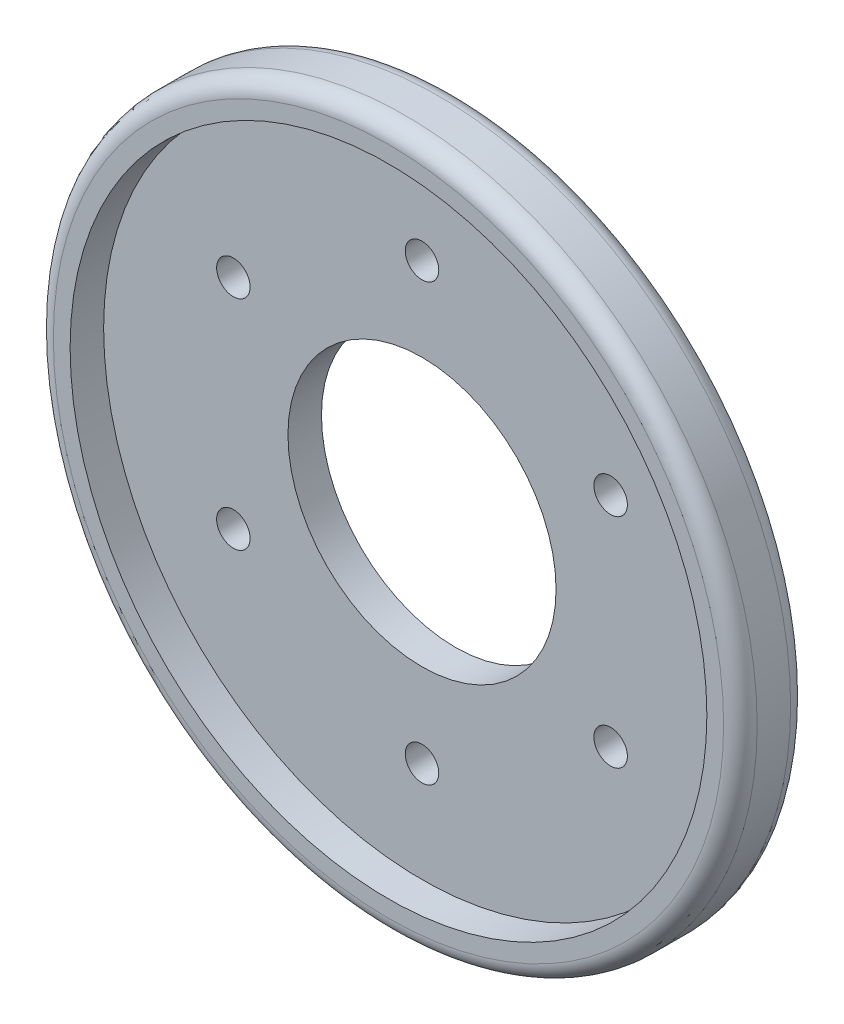
ISO-10303-21;
HEADER;
FILE_DESCRIPTION(('STEP AP214'),'2;1');
FILE_NAME('part.step','',(''),(''),'','','');
FILE_SCHEMA(('AUTOMOTIVE_DESIGN { 1 0 10303 214 1 1 1 1 }'));
ENDSEC;
DATA;
#1=APPLICATION_CONTEXT('core data for automotive mechanical design processes');
#2=APPLICATION_PROTOCOL_DEFINITION('international standard','automotive_design',2000,#1);
#3=PRODUCT_CONTEXT('',#1,'mechanical');
#4=PRODUCT('Part','Part','',(#3));
#5=PRODUCT_RELATED_PRODUCT_CATEGORY('part','',(#4));
#6=PRODUCT_DEFINITION_FORMATION('','',#4);
#7=PRODUCT_DEFINITION_CONTEXT('part definition',#1,'design');
#8=PRODUCT_DEFINITION('design','',#6,#7);
#9=PRODUCT_DEFINITION_SHAPE('','',#8);
#10=(LENGTH_UNIT() NAMED_UNIT(*) SI_UNIT(.MILLI.,.METRE.));
#11=(NAMED_UNIT(*) PLANE_ANGLE_UNIT() SI_UNIT($,.RADIAN.));
#12=(NAMED_UNIT(*) SI_UNIT($,.STERADIAN.) SOLID_ANGLE_UNIT());
#13=UNCERTAINTY_MEASURE_WITH_UNIT(LENGTH_MEASURE(1.E-05),#10,'distance_accuracy_value','');
#14=(GEOMETRIC_REPRESENTATION_CONTEXT(3) GLOBAL_UNCERTAINTY_ASSIGNED_CONTEXT((#13)) GLOBAL_UNIT_ASSIGNED_CONTEXT((#10,
#11,#12)) REPRESENTATION_CONTEXT('',''));
#15=CARTESIAN_POINT('',(0.,0.,0.));
#16=DIRECTION('',(0.,0.,1.));
#17=DIRECTION('',(1.,0.,0.));
#18=AXIS2_PLACEMENT_3D('',#15,#16,#17);
#19=CARTESIAN_POINT('',(0.,0.,2.));
#20=DIRECTION('',(0.,0.,1.));
#21=DIRECTION('',(1.,0.,0.));
#22=AXIS2_PLACEMENT_3D('',#19,#20,#21);
#23=PLANE('',#22);
#24=CARTESIAN_POINT('',(0.,12.9985283473231,2.));
#25=DIRECTION('',(0.,0.,1.));
#26=DIRECTION('',(1.,0.,0.));
#27=AXIS2_PLACEMENT_3D('',#24,#25,#26);
#28=CIRCLE('',#27,1.);
#29=CARTESIAN_POINT('',(1.,12.9985283473231,2.));
#30=VERTEX_POINT('',#29);
#31=EDGE_CURVE('E92',#30,#30,#28,.T.);
#32=ORIENTED_EDGE('',*,*,#31,.F.);
#33=EDGE_LOOP('',(#32));
#34=FACE_BOUND('',#33,.T.);
#35=CARTESIAN_POINT('',(-11.2570557605939,-6.49926417366159,2.));
#36=DIRECTION('',(0.,0.,1.));
#37=DIRECTION('',(1.,0.,0.));
#38=AXIS2_PLACEMENT_3D('',#35,#36,#37);
#39=CIRCLE('',#38,1.);
#40=CARTESIAN_POINT('',(-10.2570557605939,-6.49926417366159,2.));
#41=VERTEX_POINT('',#40);
#42=EDGE_CURVE('E99',#41,#41,#39,.T.);
#43=ORIENTED_EDGE('',*,*,#42,.F.);
#44=EDGE_LOOP('',(#43));
#45=FACE_BOUND('',#44,.T.);
#46=CARTESIAN_POINT('',(0.,-12.9985283473231,2.));
#47=DIRECTION('',(0.,0.,1.));
#48=DIRECTION('',(1.,0.,0.));
#49=AXIS2_PLACEMENT_3D('',#46,#47,#48);
#50=CIRCLE('',#49,1.);
#51=CARTESIAN_POINT('',(1.,-12.9985283473231,2.));
#52=VERTEX_POINT('',#51);
#53=EDGE_CURVE('E80',#52,#52,#50,.T.);
#54=ORIENTED_EDGE('',*,*,#53,.F.);
#55=EDGE_LOOP('',(#54));
#56=FACE_BOUND('',#55,.T.);
#57=CARTESIAN_POINT('',(11.2570557605939,-6.49926417366159,2.));
#58=DIRECTION('',(0.,0.,1.));
#59=DIRECTION('',(1.,0.,0.));
#60=AXIS2_PLACEMENT_3D('',#57,#58,#59);
#61=CIRCLE('',#60,1.);
#62=CARTESIAN_POINT('',(12.2570557605939,-6.49926417366159,2.));
#63=VERTEX_POINT('',#62);
#64=EDGE_CURVE('E87',#63,#63,#61,.T.);
#65=ORIENTED_EDGE('',*,*,#64,.F.);
#66=EDGE_LOOP('',(#65));
#67=FACE_BOUND('',#66,.T.);
#68=CARTESIAN_POINT('',(-11.2570557605939,6.49926417366159,2.));
#69=DIRECTION('',(0.,0.,1.));
#70=DIRECTION('',(1.,0.,0.));
#71=AXIS2_PLACEMENT_3D('',#68,#69,#70);
#72=CIRCLE('',#71,1.00000000000001);
#73=CARTESIAN_POINT('',(-10.2570557605939,6.49926417366159,2.));
#74=VERTEX_POINT('',#73);
#75=EDGE_CURVE('E104',#74,#74,#72,.T.);
#76=ORIENTED_EDGE('',*,*,#75,.F.);
#77=EDGE_LOOP('',(#76));
#78=FACE_BOUND('',#77,.T.);
#79=CARTESIAN_POINT('',(11.2570557605939,6.49926417366159,2.));
#80=DIRECTION('',(0.,0.,1.));
#81=DIRECTION('',(1.,0.,0.));
#82=AXIS2_PLACEMENT_3D('',#79,#80,#81);
#83=CIRCLE('',#82,1.);
#84=CARTESIAN_POINT('',(12.2570557605939,6.49926417366159,2.));
#85=VERTEX_POINT('',#84);
#86=EDGE_CURVE('E74',#85,#85,#83,.T.);
#87=ORIENTED_EDGE('',*,*,#86,.F.);
#88=EDGE_LOOP('',(#87));
#89=FACE_BOUND('',#88,.T.);
#90=CARTESIAN_POINT('',(0.,0.,2.));
#91=DIRECTION('',(0.,0.,1.));
#92=DIRECTION('',(1.,0.,0.));
#93=AXIS2_PLACEMENT_3D('',#90,#91,#92);
#94=CIRCLE('',#93,8.);
#95=CARTESIAN_POINT('',(8.,0.,2.));
#96=VERTEX_POINT('',#95);
#97=EDGE_CURVE('E65',#96,#96,#94,.T.);
#98=ORIENTED_EDGE('',*,*,#97,.F.);
#99=EDGE_LOOP('',(#98));
#100=FACE_BOUND('',#99,.T.);
#101=CARTESIAN_POINT('',(0.,0.,2.));
#102=DIRECTION('',(0.,0.,1.));
#103=DIRECTION('',(1.,0.,0.));
#104=AXIS2_PLACEMENT_3D('',#101,#102,#103);
#105=CIRCLE('',#104,19.);
#106=CARTESIAN_POINT('',(19.,0.,2.));
#107=VERTEX_POINT('',#106);
#108=EDGE_CURVE('E61',#107,#107,#105,.F.);
#109=ORIENTED_EDGE('',*,*,#108,.F.);
#110=EDGE_LOOP('',(#109));
#111=FACE_BOUND('',#110,.T.);
#112=ADVANCED_FACE('F41',(#34,#45,#56,#67,#78,#89,#100,#111),#23,.T.);
#113=CARTESIAN_POINT('',(0.,0.,2.));
#114=DIRECTION('',(0.,0.,-1.));
#115=DIRECTION('',(-1.,0.,0.));
#116=AXIS2_PLACEMENT_3D('',#113,#114,#115);
#117=CYLINDRICAL_SURFACE('',#116,21.);
#118=CARTESIAN_POINT('',(0.,0.,1.));
#119=DIRECTION('',(0.,0.,1.));
#120=DIRECTION('',(1.,0.,0.));
#121=AXIS2_PLACEMENT_3D('',#118,#119,#120);
#122=CIRCLE('',#121,21.);
#123=CARTESIAN_POINT('',(21.,0.,1.));
#124=VERTEX_POINT('',#123);
#125=EDGE_CURVE('E52',#124,#124,#122,.T.);
#126=ORIENTED_EDGE('',*,*,#125,.T.);
#127=EDGE_LOOP('',(#126));
#128=FACE_BOUND('',#127,.T.);
#129=CARTESIAN_POINT('',(0.,0.,3.));
#130=DIRECTION('',(0.,0.,1.));
#131=DIRECTION('',(1.,0.,0.));
#132=AXIS2_PLACEMENT_3D('',#129,#130,#131);
#133=CIRCLE('',#132,21.);
#134=CARTESIAN_POINT('',(21.,0.,3.));
#135=VERTEX_POINT('',#134);
#136=EDGE_CURVE('E56',#135,#135,#133,.F.);
#137=ORIENTED_EDGE('',*,*,#136,.T.);
#138=EDGE_LOOP('',(#137));
#139=FACE_BOUND('',#138,.T.);
#140=ADVANCED_FACE('F123',(#128,#139),#117,.T.);
#141=CARTESIAN_POINT('',(0.,0.,2.));
#142=DIRECTION('',(0.,0.,-1.));
#143=DIRECTION('',(-1.,0.,0.));
#144=AXIS2_PLACEMENT_3D('',#141,#142,#143);
#145=CYLINDRICAL_SURFACE('',#144,8.);
#146=ORIENTED_EDGE('',*,*,#97,.T.);
#147=EDGE_LOOP('',(#146));
#148=FACE_BOUND('',#147,.T.);
#149=CARTESIAN_POINT('',(0.,0.,0.));
#150=DIRECTION('',(0.,0.,1.));
#151=DIRECTION('',(1.,0.,0.));
#152=AXIS2_PLACEMENT_3D('',#149,#150,#151);
#153=CIRCLE('',#152,8.);
#154=CARTESIAN_POINT('',(8.,0.,0.));
#155=VERTEX_POINT('',#154);
#156=EDGE_CURVE('E62',#155,#155,#153,.T.);
#157=ORIENTED_EDGE('',*,*,#156,.F.);
#158=EDGE_LOOP('',(#157));
#159=FACE_BOUND('',#158,.T.);
#160=ADVANCED_FACE('F153',(#148,#159),#145,.F.);
#161=CARTESIAN_POINT('',(0.,0.,0.));
#162=DIRECTION('',(0.,0.,1.));
#163=DIRECTION('',(1.,0.,0.));
#164=AXIS2_PLACEMENT_3D('',#161,#162,#163);
#165=PLANE('',#164);
#166=CARTESIAN_POINT('',(0.,12.9985283473231,0.));
#167=DIRECTION('',(0.,0.,1.));
#168=DIRECTION('',(1.,0.,0.));
#169=AXIS2_PLACEMENT_3D('',#166,#167,#168);
#170=CIRCLE('',#169,1.);
#171=CARTESIAN_POINT('',(1.,12.9985283473231,0.));
#172=VERTEX_POINT('',#171);
#173=EDGE_CURVE('E95',#172,#172,#170,.T.);
#174=ORIENTED_EDGE('',*,*,#173,.T.);
#175=EDGE_LOOP('',(#174));
#176=FACE_BOUND('',#175,.T.);
#177=CARTESIAN_POINT('',(-11.2570557605939,-6.49926417366159,0.));
#178=DIRECTION('',(0.,0.,1.));
#179=DIRECTION('',(1.,0.,0.));
#180=AXIS2_PLACEMENT_3D('',#177,#178,#179);
#181=CIRCLE('',#180,1.);
#182=CARTESIAN_POINT('',(-10.2570557605939,-6.49926417366159,0.));
#183=VERTEX_POINT('',#182);
#184=EDGE_CURVE('E84',#183,#183,#181,.T.);
#185=ORIENTED_EDGE('',*,*,#184,.T.);
#186=EDGE_LOOP('',(#185));
#187=FACE_BOUND('',#186,.T.);
#188=CARTESIAN_POINT('',(0.,-12.9985283473231,0.));
#189=DIRECTION('',(0.,0.,1.));
#190=DIRECTION('',(1.,0.,0.));
#191=AXIS2_PLACEMENT_3D('',#188,#189,#190);
#192=CIRCLE('',#191,1.);
#193=CARTESIAN_POINT('',(1.,-12.9985283473231,0.));
#194=VERTEX_POINT('',#193);
#195=EDGE_CURVE('E83',#194,#194,#192,.T.);
#196=ORIENTED_EDGE('',*,*,#195,.T.);
#197=EDGE_LOOP('',(#196));
#198=FACE_BOUND('',#197,.T.);
#199=CARTESIAN_POINT('',(11.2570557605939,-6.49926417366159,0.));
#200=DIRECTION('',(0.,0.,1.));
#201=DIRECTION('',(1.,0.,0.));
#202=AXIS2_PLACEMENT_3D('',#199,#200,#201);
#203=CIRCLE('',#202,1.);
#204=CARTESIAN_POINT('',(12.2570557605939,-6.49926417366159,0.));
#205=VERTEX_POINT('',#204);
#206=EDGE_CURVE('E77',#205,#205,#203,.T.);
#207=ORIENTED_EDGE('',*,*,#206,.T.);
#208=EDGE_LOOP('',(#207));
#209=FACE_BOUND('',#208,.T.);
#210=CARTESIAN_POINT('',(-11.2570557605939,6.49926417366159,0.));
#211=DIRECTION('',(0.,0.,1.));
#212=DIRECTION('',(1.,0.,0.));
#213=AXIS2_PLACEMENT_3D('',#210,#211,#212);
#214=CIRCLE('',#213,1.00000000000001);
#215=CARTESIAN_POINT('',(-10.2570557605939,6.49926417366159,0.));
#216=VERTEX_POINT('',#215);
#217=EDGE_CURVE('E96',#216,#216,#214,.T.);
#218=ORIENTED_EDGE('',*,*,#217,.T.);
#219=EDGE_LOOP('',(#218));
#220=FACE_BOUND('',#219,.T.);
#221=CARTESIAN_POINT('',(11.2570557605939,6.49926417366159,0.));
#222=DIRECTION('',(0.,0.,1.));
#223=DIRECTION('',(1.,0.,0.));
#224=AXIS2_PLACEMENT_3D('',#221,#222,#223);
#225=CIRCLE('',#224,1.);
#226=CARTESIAN_POINT('',(12.2570557605939,6.49926417366159,0.));
#227=VERTEX_POINT('',#226);
#228=EDGE_CURVE('E73',#227,#227,#225,.T.);
#229=ORIENTED_EDGE('',*,*,#228,.T.);
#230=EDGE_LOOP('',(#229));
#231=FACE_BOUND('',#230,.T.);
#232=CARTESIAN_POINT('',(0.,0.,0.));
#233=DIRECTION('',(0.,0.,1.));
#234=DIRECTION('',(1.,0.,0.));
#235=AXIS2_PLACEMENT_3D('',#232,#233,#234);
#236=CIRCLE('',#235,20.);
#237=CARTESIAN_POINT('',(20.,0.,0.));
#238=VERTEX_POINT('',#237);
#239=EDGE_CURVE('E48',#238,#238,#236,.F.);
#240=ORIENTED_EDGE('',*,*,#239,.T.);
#241=EDGE_LOOP('',(#240));
#242=FACE_BOUND('',#241,.T.);
#243=ORIENTED_EDGE('',*,*,#156,.T.);
#244=EDGE_LOOP('',(#243));
#245=FACE_BOUND('',#244,.T.);
#246=ADVANCED_FACE('F110',(#176,#187,#198,#209,#220,#231,#242,#245),#165,.F.);
#247=CARTESIAN_POINT('',(0.,0.,4.));
#248=DIRECTION('',(0.,0.,-1.));
#249=DIRECTION('',(-1.,0.,0.));
#250=AXIS2_PLACEMENT_3D('',#247,#248,#249);
#251=CYLINDRICAL_SURFACE('',#250,19.);
#252=ORIENTED_EDGE('',*,*,#108,.T.);
#253=EDGE_LOOP('',(#252));
#254=FACE_BOUND('',#253,.T.);
#255=CARTESIAN_POINT('',(0.,0.,4.));
#256=DIRECTION('',(0.,0.,1.));
#257=DIRECTION('',(1.,0.,0.));
#258=AXIS2_PLACEMENT_3D('',#255,#256,#257);
#259=CIRCLE('',#258,19.);
#260=CARTESIAN_POINT('',(19.,0.,4.));
#261=VERTEX_POINT('',#260);
#262=EDGE_CURVE('E66',#261,#261,#259,.T.);
#263=ORIENTED_EDGE('',*,*,#262,.T.);
#264=EDGE_LOOP('',(#263));
#265=FACE_BOUND('',#264,.T.);
#266=ADVANCED_FACE('F132',(#254,#265),#251,.F.);
#267=CARTESIAN_POINT('',(0.,0.,4.));
#268=DIRECTION('',(0.,0.,1.));
#269=DIRECTION('',(1.,0.,0.));
#270=AXIS2_PLACEMENT_3D('',#267,#268,#269);
#271=PLANE('',#270);
#272=CARTESIAN_POINT('',(0.,0.,4.));
#273=DIRECTION('',(0.,0.,1.));
#274=DIRECTION('',(1.,0.,0.));
#275=AXIS2_PLACEMENT_3D('',#272,#273,#274);
#276=CIRCLE('',#275,20.);
#277=CARTESIAN_POINT('',(20.,0.,4.));
#278=VERTEX_POINT('',#277);
#279=EDGE_CURVE('E10',#278,#278,#276,.T.);
#280=ORIENTED_EDGE('',*,*,#279,.T.);
#281=EDGE_LOOP('',(#280));
#282=FACE_BOUND('',#281,.T.);
#283=ORIENTED_EDGE('',*,*,#262,.F.);
#284=EDGE_LOOP('',(#283));
#285=FACE_BOUND('',#284,.T.);
#286=ADVANCED_FACE('F135',(#282,#285),#271,.T.);
#287=CARTESIAN_POINT('',(0.,0.,1.));
#288=DIRECTION('',(0.,0.,1.));
#289=DIRECTION('',(1.,0.,0.));
#290=AXIS2_PLACEMENT_3D('',#287,#288,#289);
#291=TOROIDAL_SURFACE('',#290,20.,1.);
#292=ORIENTED_EDGE('',*,*,#239,.F.);
#293=EDGE_LOOP('',(#292));
#294=FACE_BOUND('',#293,.T.);
#295=ORIENTED_EDGE('',*,*,#125,.F.);
#296=EDGE_LOOP('',(#295));
#297=FACE_BOUND('',#296,.T.);
#298=ADVANCED_FACE('F140',(#294,#297),#291,.T.);
#299=CARTESIAN_POINT('',(0.,0.,3.));
#300=DIRECTION('',(0.,0.,1.));
#301=DIRECTION('',(1.,0.,0.));
#302=AXIS2_PLACEMENT_3D('',#299,#300,#301);
#303=TOROIDAL_SURFACE('',#302,20.,1.);
#304=ORIENTED_EDGE('',*,*,#136,.F.);
#305=EDGE_LOOP('',(#304));
#306=FACE_BOUND('',#305,.T.);
#307=ORIENTED_EDGE('',*,*,#279,.F.);
#308=EDGE_LOOP('',(#307));
#309=FACE_BOUND('',#308,.T.);
#310=ADVANCED_FACE('F43',(#306,#309),#303,.T.);
#311=CARTESIAN_POINT('',(11.2570557605939,6.49926417366159,0.));
#312=DIRECTION('',(0.,0.,1.));
#313=DIRECTION('',(1.,0.,0.));
#314=AXIS2_PLACEMENT_3D('',#311,#312,#313);
#315=CYLINDRICAL_SURFACE('',#314,1.);
#316=ORIENTED_EDGE('',*,*,#228,.F.);
#317=EDGE_LOOP('',(#316));
#318=FACE_BOUND('',#317,.T.);
#319=ORIENTED_EDGE('',*,*,#86,.T.);
#320=EDGE_LOOP('',(#319));
#321=FACE_BOUND('',#320,.T.);
#322=ADVANCED_FACE('F117',(#318,#321),#315,.F.);
#323=CARTESIAN_POINT('',(-11.2570557605939,6.49926417366159,0.));
#324=DIRECTION('',(0.,0.,1.));
#325=DIRECTION('',(1.,0.,0.));
#326=AXIS2_PLACEMENT_3D('',#323,#324,#325);
#327=CYLINDRICAL_SURFACE('',#326,1.00000000000001);
#328=ORIENTED_EDGE('',*,*,#217,.F.);
#329=EDGE_LOOP('',(#328));
#330=FACE_BOUND('',#329,.T.);
#331=ORIENTED_EDGE('',*,*,#75,.T.);
#332=EDGE_LOOP('',(#331));
#333=FACE_BOUND('',#332,.T.);
#334=ADVANCED_FACE('F113',(#330,#333),#327,.F.);
#335=CARTESIAN_POINT('',(11.2570557605939,-6.49926417366159,0.));
#336=DIRECTION('',(0.,0.,1.));
#337=DIRECTION('',(1.,0.,0.));
#338=AXIS2_PLACEMENT_3D('',#335,#336,#337);
#339=CYLINDRICAL_SURFACE('',#338,1.);
#340=ORIENTED_EDGE('',*,*,#206,.F.);
#341=EDGE_LOOP('',(#340));
#342=FACE_BOUND('',#341,.T.);
#343=ORIENTED_EDGE('',*,*,#64,.T.);
#344=EDGE_LOOP('',(#343));
#345=FACE_BOUND('',#344,.T.);
#346=ADVANCED_FACE('F116',(#342,#345),#339,.F.);
#347=CARTESIAN_POINT('',(0.,-12.9985283473231,0.));
#348=DIRECTION('',(0.,0.,1.));
#349=DIRECTION('',(1.,0.,0.));
#350=AXIS2_PLACEMENT_3D('',#347,#348,#349);
#351=CYLINDRICAL_SURFACE('',#350,1.);
#352=ORIENTED_EDGE('',*,*,#195,.F.);
#353=EDGE_LOOP('',(#352));
#354=FACE_BOUND('',#353,.T.);
#355=ORIENTED_EDGE('',*,*,#53,.T.);
#356=EDGE_LOOP('',(#355));
#357=FACE_BOUND('',#356,.T.);
#358=ADVANCED_FACE('F189',(#354,#357),#351,.F.);
#359=CARTESIAN_POINT('',(-11.2570557605939,-6.49926417366159,0.));
#360=DIRECTION('',(0.,0.,1.));
#361=DIRECTION('',(1.,0.,0.));
#362=AXIS2_PLACEMENT_3D('',#359,#360,#361);
#363=CYLINDRICAL_SURFACE('',#362,1.);
#364=ORIENTED_EDGE('',*,*,#184,.F.);
#365=EDGE_LOOP('',(#364));
#366=FACE_BOUND('',#365,.T.);
#367=ORIENTED_EDGE('',*,*,#42,.T.);
#368=EDGE_LOOP('',(#367));
#369=FACE_BOUND('',#368,.T.);
#370=ADVANCED_FACE('F197',(#366,#369),#363,.F.);
#371=CARTESIAN_POINT('',(0.,12.9985283473231,0.));
#372=DIRECTION('',(0.,0.,1.));
#373=DIRECTION('',(1.,0.,0.));
#374=AXIS2_PLACEMENT_3D('',#371,#372,#373);
#375=CYLINDRICAL_SURFACE('',#374,1.);
#376=ORIENTED_EDGE('',*,*,#173,.F.);
#377=EDGE_LOOP('',(#376));
#378=FACE_BOUND('',#377,.T.);
#379=ORIENTED_EDGE('',*,*,#31,.T.);
#380=EDGE_LOOP('',(#379));
#381=FACE_BOUND('',#380,.T.);
#382=ADVANCED_FACE('F204',(#378,#381),#375,.F.);
#383=CLOSED_SHELL('',(#112,#140,#160,#246,#266,#286,#298,#310,#322,#334,#346,#358,#370,#382));
#384=MANIFOLD_SOLID_BREP('B2',#383);
#385=ADVANCED_BREP_SHAPE_REPRESENTATION('',(#18,#384),#14);
#386=SHAPE_DEFINITION_REPRESENTATION(#9,#385);
ENDSEC;
END-ISO-10303-21;
